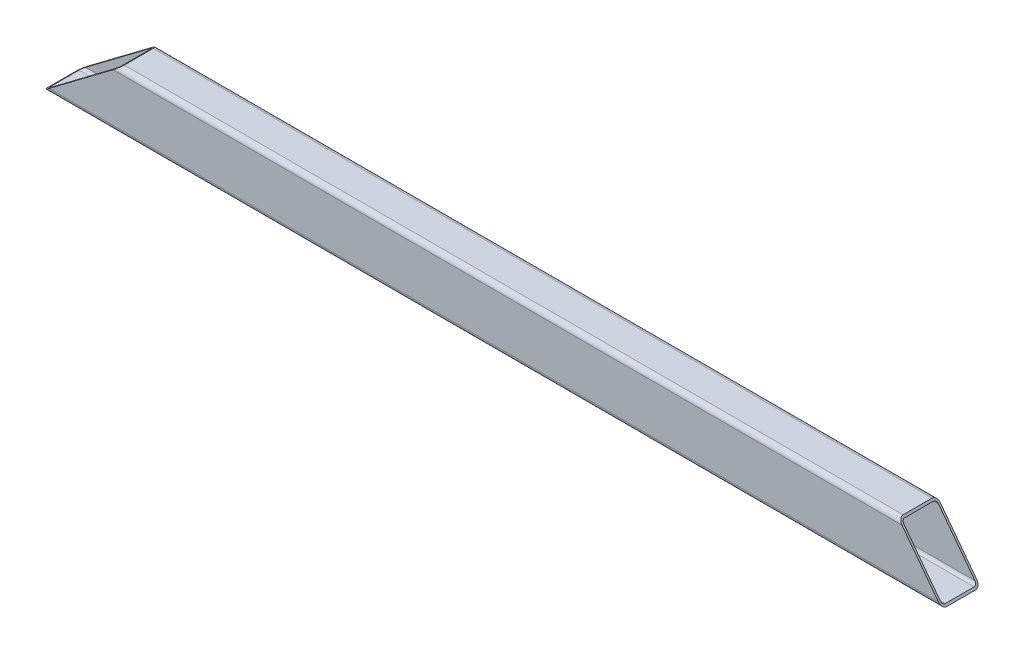
ISO-10303-21;
HEADER;
FILE_DESCRIPTION(('STEP AP214'),'2;1');
FILE_NAME('part.step','',(''),(''),'','','');
FILE_SCHEMA(('AUTOMOTIVE_DESIGN { 1 0 10303 214 1 1 1 1 }'));
ENDSEC;
DATA;
#1=APPLICATION_CONTEXT('core data for automotive mechanical design processes');
#2=APPLICATION_PROTOCOL_DEFINITION('international standard','automotive_design',2000,#1);
#3=PRODUCT_CONTEXT('',#1,'mechanical');
#4=PRODUCT('Part','Part','',(#3));
#5=PRODUCT_RELATED_PRODUCT_CATEGORY('part','',(#4));
#6=PRODUCT_DEFINITION_FORMATION('','',#4);
#7=PRODUCT_DEFINITION_CONTEXT('part definition',#1,'design');
#8=PRODUCT_DEFINITION('design','',#6,#7);
#9=PRODUCT_DEFINITION_SHAPE('','',#8);
#10=(LENGTH_UNIT() NAMED_UNIT(*) SI_UNIT(.MILLI.,.METRE.));
#11=(NAMED_UNIT(*) PLANE_ANGLE_UNIT() SI_UNIT($,.RADIAN.));
#12=(NAMED_UNIT(*) SI_UNIT($,.STERADIAN.) SOLID_ANGLE_UNIT());
#13=UNCERTAINTY_MEASURE_WITH_UNIT(LENGTH_MEASURE(1.E-05),#10,'distance_accuracy_value','');
#14=(GEOMETRIC_REPRESENTATION_CONTEXT(3) GLOBAL_UNCERTAINTY_ASSIGNED_CONTEXT((#13)) GLOBAL_UNIT_ASSIGNED_CONTEXT((#10,
#11,#12)) REPRESENTATION_CONTEXT('',''));
#15=CARTESIAN_POINT('',(0.,0.,0.));
#16=DIRECTION('',(0.,0.,1.));
#17=DIRECTION('',(1.,0.,0.));
#18=AXIS2_PLACEMENT_3D('',#15,#16,#17);
#19=CARTESIAN_POINT('',(941.8082,-49.9999999999998,30.));
#20=DIRECTION('',(-1.,0.,0.));
#21=DIRECTION('',(0.,-1.,0.));
#22=AXIS2_PLACEMENT_3D('',#19,#20,#21);
#23=CYLINDRICAL_SURFACE('',#22,6.);
#24=CARTESIAN_POINT('',(-911.921350372571,-50.,30.));
#25=DIRECTION('',(0.601815023152053,-0.79863551004729,0.));
#26=DIRECTION('',(-0.79863551004729,-0.601815023152053,0.));
#27=AXIS2_PLACEMENT_3D('',#24,#25,#26);
#28=ELLIPSE('',#27,9.96984084673483,6.);
#29=CARTESIAN_POINT('',(-911.921350372572,-50.0000000000001,36.));
#30=VERTEX_POINT('',#29);
#31=CARTESIAN_POINT('',(-919.883619302294,-56.,30.));
#32=VERTEX_POINT('',#31);
#33=EDGE_CURVE('E84',#30,#32,#28,.T.);
#34=ORIENTED_EDGE('',*,*,#33,.F.);
#35=DIRECTION('',(-1.,0.,0.));
#36=VECTOR('',#35,1.);
#37=CARTESIAN_POINT('',(941.8082,-49.9999999999998,36.));
#38=LINE('',#37,#36);
#39=CARTESIAN_POINT('',(934.272659498973,-50.,36.));
#40=VERTEX_POINT('',#39);
#41=EDGE_CURVE('E70',#40,#30,#38,.T.);
#42=ORIENTED_EDGE('',*,*,#41,.F.);
#43=CARTESIAN_POINT('',(934.272659498972,-49.9999999999997,30.));
#44=DIRECTION('',(-0.798635510047296,-0.601815023152044,0.));
#45=DIRECTION('',(-0.601815023152044,0.798635510047296,0.));
#46=AXIS2_PLACEMENT_3D('',#43,#44,#45);
#47=ELLIPSE('',#46,7.51281394893732,6.);
#48=CARTESIAN_POINT('',(938.793983799589,-55.9999999999996,30.));
#49=VERTEX_POINT('',#48);
#50=EDGE_CURVE('E254',#49,#40,#47,.T.);
#51=ORIENTED_EDGE('',*,*,#50,.F.);
#52=DIRECTION('',(-1.,0.,0.));
#53=VECTOR('',#52,1.);
#54=CARTESIAN_POINT('',(941.808200000001,-55.9999999999997,30.));
#55=LINE('',#54,#53);
#56=EDGE_CURVE('E215',#49,#32,#55,.T.);
#57=ORIENTED_EDGE('',*,*,#56,.T.);
#58=EDGE_LOOP('',(#34,#42,#51,#57));
#59=FACE_BOUND('',#58,.T.);
#60=ADVANCED_FACE('F62',(#59),#23,.F.);
#61=CARTESIAN_POINT('',(941.8082,-49.9999999999998,36.));
#62=DIRECTION('',(0.,0.,-1.));
#63=DIRECTION('',(-1.,0.,0.));
#64=AXIS2_PLACEMENT_3D('',#61,#62,#63);
#65=PLANE('',#64);
#66=DIRECTION('',(-0.79863551004729,-0.601815023152053,0.));
#67=VECTOR('',#66,1.);
#68=CARTESIAN_POINT('',(270.42198064597,840.959605701061,36.));
#69=LINE('',#68,#67);
#70=CARTESIAN_POINT('',(-779.216868210532,50.,36.));
#71=VERTEX_POINT('',#70);
#72=EDGE_CURVE('E252',#71,#30,#69,.T.);
#73=ORIENTED_EDGE('',*,*,#72,.F.);
#74=DIRECTION('',(-1.,0.,0.));
#75=VECTOR('',#74,1.);
#76=CARTESIAN_POINT('',(941.8082,50.0000000000003,36.));
#77=LINE('',#76,#75);
#78=CARTESIAN_POINT('',(858.917254488694,50.0000000000003,36.));
#79=VERTEX_POINT('',#78);
#80=EDGE_CURVE('E243',#79,#71,#77,.T.);
#81=ORIENTED_EDGE('',*,*,#80,.F.);
#82=DIRECTION('',(-0.601815023152044,0.798635510047296,0.));
#83=VECTOR('',#82,1.);
#84=CARTESIAN_POINT('',(937.001891520308,-53.6218132209147,36.));
#85=LINE('',#84,#83);
#86=EDGE_CURVE('E253',#40,#79,#85,.T.);
#87=ORIENTED_EDGE('',*,*,#86,.F.);
#88=ORIENTED_EDGE('',*,*,#41,.T.);
#89=EDGE_LOOP('',(#73,#81,#87,#88));
#90=FACE_BOUND('',#89,.T.);
#91=ADVANCED_FACE('F250',(#90),#65,.T.);
#92=CARTESIAN_POINT('',(941.808200000001,50.0000000000001,30.));
#93=DIRECTION('',(-1.,0.,0.));
#94=DIRECTION('',(0.,-1.,0.));
#95=AXIS2_PLACEMENT_3D('',#92,#93,#94);
#96=CYLINDRICAL_SURFACE('',#95,6.);
#97=CARTESIAN_POINT('',(-779.216868210532,50.,30.));
#98=DIRECTION('',(0.601815023152053,-0.79863551004729,0.));
#99=DIRECTION('',(-0.79863551004729,-0.601815023152053,0.));
#100=AXIS2_PLACEMENT_3D('',#97,#98,#99);
#101=ELLIPSE('',#100,9.96984084673483,6.);
#102=CARTESIAN_POINT('',(-771.25459928081,56.,30.));
#103=VERTEX_POINT('',#102);
#104=EDGE_CURVE('E256',#103,#71,#101,.T.);
#105=ORIENTED_EDGE('',*,*,#104,.F.);
#106=DIRECTION('',(-1.,0.,0.));
#107=VECTOR('',#106,1.);
#108=CARTESIAN_POINT('',(941.8082,56.0000000000001,30.));
#109=LINE('',#108,#107);
#110=CARTESIAN_POINT('',(854.395930188077,56.0000000000001,30.));
#111=VERTEX_POINT('',#110);
#112=EDGE_CURVE('E240',#111,#103,#109,.T.);
#113=ORIENTED_EDGE('',*,*,#112,.F.);
#114=CARTESIAN_POINT('',(858.917254488694,50.0000000000003,30.));
#115=DIRECTION('',(-0.798635510047296,-0.601815023152044,0.));
#116=DIRECTION('',(-0.601815023152044,0.798635510047296,0.));
#117=AXIS2_PLACEMENT_3D('',#114,#115,#116);
#118=ELLIPSE('',#117,7.51281394893732,6.);
#119=EDGE_CURVE('E282',#79,#111,#118,.T.);
#120=ORIENTED_EDGE('',*,*,#119,.F.);
#121=ORIENTED_EDGE('',*,*,#80,.T.);
#122=EDGE_LOOP('',(#105,#113,#120,#121));
#123=FACE_BOUND('',#122,.T.);
#124=ADVANCED_FACE('F321',(#123),#96,.F.);
#125=CARTESIAN_POINT('',(941.8082,56.0000000000001,30.));
#126=DIRECTION('',(0.,-1.,0.));
#127=DIRECTION('',(1.,0.,0.));
#128=AXIS2_PLACEMENT_3D('',#125,#126,#127);
#129=PLANE('',#128);
#130=DIRECTION('',(0.,0.,1.));
#131=VECTOR('',#130,1.);
#132=CARTESIAN_POINT('',(-771.25459928081,56.,29.9999999999997));
#133=LINE('',#132,#131);
#134=CARTESIAN_POINT('',(-771.25459928081,56.,-30.));
#135=VERTEX_POINT('',#134);
#136=EDGE_CURVE('E316',#135,#103,#133,.T.);
#137=ORIENTED_EDGE('',*,*,#136,.F.);
#138=DIRECTION('',(-1.,0.,0.));
#139=VECTOR('',#138,1.);
#140=CARTESIAN_POINT('',(941.8082,56.0000000000001,-30.));
#141=LINE('',#140,#139);
#142=CARTESIAN_POINT('',(854.395930188077,56.0000000000001,-30.));
#143=VERTEX_POINT('',#142);
#144=EDGE_CURVE('E237',#143,#135,#141,.T.);
#145=ORIENTED_EDGE('',*,*,#144,.F.);
#146=DIRECTION('',(0.,0.,-1.));
#147=VECTOR('',#146,1.);
#148=CARTESIAN_POINT('',(854.395930188077,56.0000000000001,30.));
#149=LINE('',#148,#147);
#150=EDGE_CURVE('E280',#111,#143,#149,.T.);
#151=ORIENTED_EDGE('',*,*,#150,.F.);
#152=ORIENTED_EDGE('',*,*,#112,.T.);
#153=EDGE_LOOP('',(#137,#145,#151,#152));
#154=FACE_BOUND('',#153,.T.);
#155=ADVANCED_FACE('F325',(#154),#129,.T.);
#156=CARTESIAN_POINT('',(941.808200000001,50.0000000000001,-30.));
#157=DIRECTION('',(-1.,0.,0.));
#158=DIRECTION('',(0.,-1.,0.));
#159=AXIS2_PLACEMENT_3D('',#156,#157,#158);
#160=CYLINDRICAL_SURFACE('',#159,6.);
#161=CARTESIAN_POINT('',(-779.216868210532,50.,-30.));
#162=DIRECTION('',(0.601815023152053,-0.79863551004729,0.));
#163=DIRECTION('',(-0.79863551004729,-0.601815023152053,0.));
#164=AXIS2_PLACEMENT_3D('',#161,#162,#163);
#165=ELLIPSE('',#164,9.96984084673483,6.);
#166=CARTESIAN_POINT('',(-779.216868210532,50.,-36.));
#167=VERTEX_POINT('',#166);
#168=EDGE_CURVE('E314',#167,#135,#165,.T.);
#169=ORIENTED_EDGE('',*,*,#168,.F.);
#170=DIRECTION('',(-1.,0.,0.));
#171=VECTOR('',#170,1.);
#172=CARTESIAN_POINT('',(941.8082,50.0000000000003,-36.));
#173=LINE('',#172,#171);
#174=CARTESIAN_POINT('',(858.917254488694,50.0000000000003,-36.));
#175=VERTEX_POINT('',#174);
#176=EDGE_CURVE('E234',#175,#167,#173,.T.);
#177=ORIENTED_EDGE('',*,*,#176,.F.);
#178=CARTESIAN_POINT('',(858.917254488694,50.0000000000003,-30.));
#179=DIRECTION('',(-0.798635510047296,-0.601815023152044,0.));
#180=DIRECTION('',(-0.601815023152044,0.798635510047296,0.));
#181=AXIS2_PLACEMENT_3D('',#178,#179,#180);
#182=ELLIPSE('',#181,7.51281394893732,6.);
#183=EDGE_CURVE('E278',#143,#175,#182,.T.);
#184=ORIENTED_EDGE('',*,*,#183,.F.);
#185=ORIENTED_EDGE('',*,*,#144,.T.);
#186=EDGE_LOOP('',(#169,#177,#184,#185));
#187=FACE_BOUND('',#186,.T.);
#188=ADVANCED_FACE('F333',(#187),#160,.F.);
#189=CARTESIAN_POINT('',(941.8082,50.0000000000003,-36.));
#190=DIRECTION('',(0.,0.,1.));
#191=DIRECTION('',(0.,-1.,0.));
#192=AXIS2_PLACEMENT_3D('',#189,#190,#191);
#193=PLANE('',#192);
#194=DIRECTION('',(0.79863551004729,0.601815023152053,0.));
#195=VECTOR('',#194,1.);
#196=CARTESIAN_POINT('',(318.485065442886,877.177737910211,-35.9999999999998));
#197=LINE('',#196,#195);
#198=CARTESIAN_POINT('',(-911.921350372571,-49.9999999999999,-36.));
#199=VERTEX_POINT('',#198);
#200=EDGE_CURVE('E312',#199,#167,#197,.T.);
#201=ORIENTED_EDGE('',*,*,#200,.F.);
#202=DIRECTION('',(-1.,0.,0.));
#203=VECTOR('',#202,1.);
#204=CARTESIAN_POINT('',(941.8082,-49.9999999999998,-36.));
#205=LINE('',#204,#203);
#206=CARTESIAN_POINT('',(934.272659498972,-49.9999999999997,-36.));
#207=VERTEX_POINT('',#206);
#208=EDGE_CURVE('E227',#207,#199,#205,.T.);
#209=ORIENTED_EDGE('',*,*,#208,.F.);
#210=DIRECTION('',(0.601815023152044,-0.798635510047296,0.));
#211=VECTOR('',#210,1.);
#212=CARTESIAN_POINT('',(888.938806723393,10.1600545699359,-36.));
#213=LINE('',#212,#211);
#214=EDGE_CURVE('E276',#175,#207,#213,.T.);
#215=ORIENTED_EDGE('',*,*,#214,.F.);
#216=ORIENTED_EDGE('',*,*,#176,.T.);
#217=EDGE_LOOP('',(#201,#209,#215,#216));
#218=FACE_BOUND('',#217,.T.);
#219=ADVANCED_FACE('F336',(#218),#193,.T.);
#220=CARTESIAN_POINT('',(941.8082,-49.9999999999998,-30.));
#221=DIRECTION('',(-1.,0.,0.));
#222=DIRECTION('',(0.,-1.,0.));
#223=AXIS2_PLACEMENT_3D('',#220,#221,#222);
#224=CYLINDRICAL_SURFACE('',#223,6.);
#225=CARTESIAN_POINT('',(-911.921350372571,-50.,-30.));
#226=DIRECTION('',(0.601815023152053,-0.79863551004729,0.));
#227=DIRECTION('',(-0.79863551004729,-0.601815023152053,0.));
#228=AXIS2_PLACEMENT_3D('',#225,#226,#227);
#229=ELLIPSE('',#228,9.96984084673483,6.);
#230=CARTESIAN_POINT('',(-919.883619302294,-56.,-30.));
#231=VERTEX_POINT('',#230);
#232=EDGE_CURVE('E306',#231,#199,#229,.T.);
#233=ORIENTED_EDGE('',*,*,#232,.F.);
#234=DIRECTION('',(-1.,0.,0.));
#235=VECTOR('',#234,1.);
#236=CARTESIAN_POINT('',(941.808200000001,-55.9999999999997,-30.));
#237=LINE('',#236,#235);
#238=CARTESIAN_POINT('',(938.793983799589,-55.9999999999996,-30.));
#239=VERTEX_POINT('',#238);
#240=EDGE_CURVE('E221',#239,#231,#237,.T.);
#241=ORIENTED_EDGE('',*,*,#240,.F.);
#242=CARTESIAN_POINT('',(934.272659498972,-49.9999999999997,-30.));
#243=DIRECTION('',(-0.798635510047296,-0.601815023152044,0.));
#244=DIRECTION('',(-0.601815023152044,0.798635510047296,0.));
#245=AXIS2_PLACEMENT_3D('',#242,#243,#244);
#246=ELLIPSE('',#245,7.51281394893732,6.);
#247=EDGE_CURVE('E274',#207,#239,#246,.T.);
#248=ORIENTED_EDGE('',*,*,#247,.F.);
#249=ORIENTED_EDGE('',*,*,#208,.T.);
#250=EDGE_LOOP('',(#233,#241,#248,#249));
#251=FACE_BOUND('',#250,.T.);
#252=ADVANCED_FACE('F343',(#251),#224,.F.);
#253=CARTESIAN_POINT('',(941.8082,-49.9999999999998,30.));
#254=DIRECTION('',(-1.,0.,0.));
#255=DIRECTION('',(0.,-1.,0.));
#256=AXIS2_PLACEMENT_3D('',#253,#254,#255);
#257=CYLINDRICAL_SURFACE('',#256,10.);
#258=DIRECTION('',(-1.,0.,0.));
#259=VECTOR('',#258,1.);
#260=CARTESIAN_POINT('',(941.8082,-49.9999999999998,40.));
#261=LINE('',#260,#259);
#262=CARTESIAN_POINT('',(934.272659498973,-50.,40.));
#263=VERTEX_POINT('',#262);
#264=CARTESIAN_POINT('',(-911.921350372572,-50.,40.));
#265=VERTEX_POINT('',#264);
#266=EDGE_CURVE('E195',#263,#265,#261,.T.);
#267=ORIENTED_EDGE('',*,*,#266,.T.);
#268=CARTESIAN_POINT('',(-911.921350372571,-50.,30.));
#269=DIRECTION('',(0.601815023152053,-0.79863551004729,0.));
#270=DIRECTION('',(-0.79863551004729,-0.601815023152053,0.));
#271=AXIS2_PLACEMENT_3D('',#268,#269,#270);
#272=ELLIPSE('',#271,16.6164014112247,10.);
#273=CARTESIAN_POINT('',(-925.191798588775,-59.9999999999999,29.9999999999999));
#274=VERTEX_POINT('',#273);
#275=EDGE_CURVE('E77',#265,#274,#272,.T.);
#276=ORIENTED_EDGE('',*,*,#275,.T.);
#277=DIRECTION('',(-1.,0.,0.));
#278=VECTOR('',#277,1.);
#279=CARTESIAN_POINT('',(941.8082,-59.9999999999996,29.9999999999999));
#280=LINE('',#279,#278);
#281=CARTESIAN_POINT('',(941.8082,-59.9999999999996,29.9999999999999));
#282=VERTEX_POINT('',#281);
#283=EDGE_CURVE('E213',#282,#274,#280,.T.);
#284=ORIENTED_EDGE('',*,*,#283,.F.);
#285=CARTESIAN_POINT('',(934.272659498972,-49.9999999999997,30.));
#286=DIRECTION('',(-0.798635510047296,-0.601815023152044,0.));
#287=DIRECTION('',(-0.601815023152044,0.798635510047296,0.));
#288=AXIS2_PLACEMENT_3D('',#285,#286,#287);
#289=ELLIPSE('',#288,12.5213565815622,10.);
#290=EDGE_CURVE('E293',#282,#263,#289,.T.);
#291=ORIENTED_EDGE('',*,*,#290,.T.);
#292=EDGE_LOOP('',(#267,#276,#284,#291));
#293=FACE_BOUND('',#292,.T.);
#294=ADVANCED_FACE('F64',(#293),#257,.T.);
#295=CARTESIAN_POINT('',(941.8082,-59.9999999999996,29.9999999999999));
#296=DIRECTION('',(0.,1.,0.));
#297=DIRECTION('',(-1.,0.,0.));
#298=AXIS2_PLACEMENT_3D('',#295,#296,#297);
#299=PLANE('',#298);
#300=ORIENTED_EDGE('',*,*,#283,.T.);
#301=DIRECTION('',(0.,0.,1.));
#302=VECTOR('',#301,1.);
#303=CARTESIAN_POINT('',(-925.191798588775,-59.9999999999997,-40.));
#304=LINE('',#303,#302);
#305=CARTESIAN_POINT('',(-925.191798588775,-59.9999999999997,-30.));
#306=VERTEX_POINT('',#305);
#307=EDGE_CURVE('E303',#306,#274,#304,.T.);
#308=ORIENTED_EDGE('',*,*,#307,.F.);
#309=DIRECTION('',(-1.,0.,0.));
#310=VECTOR('',#309,1.);
#311=CARTESIAN_POINT('',(941.8082,-59.9999999999996,-29.9999999999999));
#312=LINE('',#311,#310);
#313=CARTESIAN_POINT('',(941.8082,-59.9999999999996,-29.9999999999999));
#314=VERTEX_POINT('',#313);
#315=EDGE_CURVE('E211',#314,#306,#312,.T.);
#316=ORIENTED_EDGE('',*,*,#315,.F.);
#317=DIRECTION('',(0.,0.,-1.));
#318=VECTOR('',#317,1.);
#319=CARTESIAN_POINT('',(941.8082,-59.9999999999996,29.9999999999999));
#320=LINE('',#319,#318);
#321=EDGE_CURVE('E199',#282,#314,#320,.T.);
#322=ORIENTED_EDGE('',*,*,#321,.F.);
#323=EDGE_LOOP('',(#300,#308,#316,#322));
#324=FACE_BOUND('',#323,.T.);
#325=ADVANCED_FACE('F302',(#324),#299,.F.);
#326=CARTESIAN_POINT('',(941.8082,-49.9999999999998,-30.));
#327=DIRECTION('',(-1.,0.,0.));
#328=DIRECTION('',(0.,-1.,0.));
#329=AXIS2_PLACEMENT_3D('',#326,#327,#328);
#330=CYLINDRICAL_SURFACE('',#329,10.);
#331=ORIENTED_EDGE('',*,*,#315,.T.);
#332=CARTESIAN_POINT('',(-911.921350372571,-50.,-30.));
#333=DIRECTION('',(0.601815023152053,-0.79863551004729,0.));
#334=DIRECTION('',(-0.79863551004729,-0.601815023152053,0.));
#335=AXIS2_PLACEMENT_3D('',#332,#333,#334);
#336=ELLIPSE('',#335,16.6164014112247,10.);
#337=CARTESIAN_POINT('',(-911.921350372571,-49.9999999999999,-40.));
#338=VERTEX_POINT('',#337);
#339=EDGE_CURVE('E262',#306,#338,#336,.T.);
#340=ORIENTED_EDGE('',*,*,#339,.T.);
#341=DIRECTION('',(-1.,0.,0.));
#342=VECTOR('',#341,1.);
#343=CARTESIAN_POINT('',(941.8082,-49.9999999999998,-40.));
#344=LINE('',#343,#342);
#345=CARTESIAN_POINT('',(934.272659498973,-50.,-40.));
#346=VERTEX_POINT('',#345);
#347=EDGE_CURVE('E208',#346,#338,#344,.T.);
#348=ORIENTED_EDGE('',*,*,#347,.F.);
#349=CARTESIAN_POINT('',(934.272659498972,-49.9999999999997,-30.));
#350=DIRECTION('',(-0.798635510047296,-0.601815023152044,0.));
#351=DIRECTION('',(-0.601815023152044,0.798635510047296,0.));
#352=AXIS2_PLACEMENT_3D('',#349,#350,#351);
#353=ELLIPSE('',#352,12.5213565815622,10.);
#354=EDGE_CURVE('E291',#346,#314,#353,.T.);
#355=ORIENTED_EDGE('',*,*,#354,.T.);
#356=EDGE_LOOP('',(#331,#340,#348,#355));
#357=FACE_BOUND('',#356,.T.);
#358=ADVANCED_FACE('F301',(#357),#330,.T.);
#359=CARTESIAN_POINT('',(941.8082,50.0000000000003,-40.));
#360=DIRECTION('',(0.,0.,1.));
#361=DIRECTION('',(1.,0.,0.));
#362=AXIS2_PLACEMENT_3D('',#359,#360,#361);
#363=PLANE('',#362);
#364=ORIENTED_EDGE('',*,*,#347,.T.);
#365=DIRECTION('',(0.79863551004729,0.601815023152053,0.));
#366=VECTOR('',#365,1.);
#367=CARTESIAN_POINT('',(-925.191798588775,-59.9999999999997,-40.));
#368=LINE('',#367,#366);
#369=CARTESIAN_POINT('',(-779.216868210531,50.0000000000002,-40.));
#370=VERTEX_POINT('',#369);
#371=EDGE_CURVE('E180',#338,#370,#368,.T.);
#372=ORIENTED_EDGE('',*,*,#371,.T.);
#373=DIRECTION('',(-1.,0.,0.));
#374=VECTOR('',#373,1.);
#375=CARTESIAN_POINT('',(941.8082,50.0000000000003,-40.));
#376=LINE('',#375,#374);
#377=CARTESIAN_POINT('',(858.917254488694,50.0000000000003,-40.));
#378=VERTEX_POINT('',#377);
#379=EDGE_CURVE('E205',#378,#370,#376,.T.);
#380=ORIENTED_EDGE('',*,*,#379,.F.);
#381=DIRECTION('',(0.601815023152044,-0.798635510047296,0.));
#382=VECTOR('',#381,1.);
#383=CARTESIAN_POINT('',(941.8082,-59.9999999999996,-40.));
#384=LINE('',#383,#382);
#385=EDGE_CURVE('E266',#378,#346,#384,.T.);
#386=ORIENTED_EDGE('',*,*,#385,.T.);
#387=EDGE_LOOP('',(#364,#372,#380,#386));
#388=FACE_BOUND('',#387,.T.);
#389=ADVANCED_FACE('F372',(#388),#363,.F.);
#390=CARTESIAN_POINT('',(941.808200000001,50.0000000000001,-30.));
#391=DIRECTION('',(-1.,0.,0.));
#392=DIRECTION('',(0.,-1.,0.));
#393=AXIS2_PLACEMENT_3D('',#390,#391,#392);
#394=CYLINDRICAL_SURFACE('',#393,10.);
#395=ORIENTED_EDGE('',*,*,#379,.T.);
#396=CARTESIAN_POINT('',(-779.216868210532,50.,-30.));
#397=DIRECTION('',(0.601815023152053,-0.79863551004729,0.));
#398=DIRECTION('',(-0.79863551004729,-0.601815023152053,0.));
#399=AXIS2_PLACEMENT_3D('',#396,#397,#398);
#400=ELLIPSE('',#399,16.6164014112247,10.);
#401=CARTESIAN_POINT('',(-765.946419994328,60.0000000000002,-29.9999999999999));
#402=VERTEX_POINT('',#401);
#403=EDGE_CURVE('E190',#370,#402,#400,.T.);
#404=ORIENTED_EDGE('',*,*,#403,.T.);
#405=DIRECTION('',(-1.,0.,0.));
#406=VECTOR('',#405,1.);
#407=CARTESIAN_POINT('',(941.808200000001,60.0000000000003,-29.9999999999999));
#408=LINE('',#407,#406);
#409=CARTESIAN_POINT('',(851.381713987666,60.0000000000001,-29.9999999999999));
#410=VERTEX_POINT('',#409);
#411=EDGE_CURVE('E197',#410,#402,#408,.T.);
#412=ORIENTED_EDGE('',*,*,#411,.F.);
#413=CARTESIAN_POINT('',(858.917254488694,50.0000000000003,-30.));
#414=DIRECTION('',(-0.798635510047296,-0.601815023152044,0.));
#415=DIRECTION('',(-0.601815023152044,0.798635510047296,0.));
#416=AXIS2_PLACEMENT_3D('',#413,#414,#415);
#417=ELLIPSE('',#416,12.5213565815622,10.);
#418=EDGE_CURVE('E288',#410,#378,#417,.T.);
#419=ORIENTED_EDGE('',*,*,#418,.T.);
#420=EDGE_LOOP('',(#395,#404,#412,#419));
#421=FACE_BOUND('',#420,.T.);
#422=ADVANCED_FACE('F368',(#421),#394,.T.);
#423=CARTESIAN_POINT('',(941.808200000001,60.0000000000003,29.9999999999999));
#424=DIRECTION('',(0.,-1.,0.));
#425=DIRECTION('',(1.,0.,0.));
#426=AXIS2_PLACEMENT_3D('',#423,#424,#425);
#427=PLANE('',#426);
#428=ORIENTED_EDGE('',*,*,#411,.T.);
#429=DIRECTION('',(0.,0.,1.));
#430=VECTOR('',#429,1.);
#431=CARTESIAN_POINT('',(-765.946419994328,60.0000000000002,-40.));
#432=LINE('',#431,#430);
#433=CARTESIAN_POINT('',(-765.946419994328,60.,30.));
#434=VERTEX_POINT('',#433);
#435=EDGE_CURVE('E304',#402,#434,#432,.T.);
#436=ORIENTED_EDGE('',*,*,#435,.T.);
#437=DIRECTION('',(-1.,0.,0.));
#438=VECTOR('',#437,1.);
#439=CARTESIAN_POINT('',(941.808200000001,60.0000000000003,29.9999999999999));
#440=LINE('',#439,#438);
#441=CARTESIAN_POINT('',(851.381713987666,60.0000000000001,30.));
#442=VERTEX_POINT('',#441);
#443=EDGE_CURVE('E189',#442,#434,#440,.T.);
#444=ORIENTED_EDGE('',*,*,#443,.F.);
#445=DIRECTION('',(0.,0.,1.));
#446=VECTOR('',#445,1.);
#447=CARTESIAN_POINT('',(851.381713987666,60.0000000000001,-40.));
#448=LINE('',#447,#446);
#449=EDGE_CURVE('E269',#410,#442,#448,.T.);
#450=ORIENTED_EDGE('',*,*,#449,.F.);
#451=EDGE_LOOP('',(#428,#436,#444,#450));
#452=FACE_BOUND('',#451,.T.);
#453=ADVANCED_FACE('F365',(#452),#427,.F.);
#454=CARTESIAN_POINT('',(941.808200000001,50.0000000000001,30.));
#455=DIRECTION('',(-1.,0.,0.));
#456=DIRECTION('',(0.,-1.,0.));
#457=AXIS2_PLACEMENT_3D('',#454,#455,#456);
#458=CYLINDRICAL_SURFACE('',#457,10.);
#459=ORIENTED_EDGE('',*,*,#443,.T.);
#460=CARTESIAN_POINT('',(-779.216868210532,50.,30.));
#461=DIRECTION('',(0.601815023152053,-0.79863551004729,0.));
#462=DIRECTION('',(-0.79863551004729,-0.601815023152053,0.));
#463=AXIS2_PLACEMENT_3D('',#460,#461,#462);
#464=ELLIPSE('',#463,16.6164014112247,10.);
#465=CARTESIAN_POINT('',(-779.216868210532,50.0000000000002,40.));
#466=VERTEX_POINT('',#465);
#467=EDGE_CURVE('E174',#434,#466,#464,.T.);
#468=ORIENTED_EDGE('',*,*,#467,.T.);
#469=DIRECTION('',(-1.,0.,0.));
#470=VECTOR('',#469,1.);
#471=CARTESIAN_POINT('',(941.8082,50.0000000000003,40.));
#472=LINE('',#471,#470);
#473=CARTESIAN_POINT('',(858.917254488694,50.0000000000003,40.));
#474=VERTEX_POINT('',#473);
#475=EDGE_CURVE('E187',#474,#466,#472,.T.);
#476=ORIENTED_EDGE('',*,*,#475,.F.);
#477=CARTESIAN_POINT('',(858.917254488694,50.0000000000003,30.));
#478=DIRECTION('',(-0.798635510047296,-0.601815023152044,0.));
#479=DIRECTION('',(-0.601815023152044,0.798635510047296,0.));
#480=AXIS2_PLACEMENT_3D('',#477,#478,#479);
#481=ELLIPSE('',#480,12.5213565815622,10.);
#482=EDGE_CURVE('E286',#474,#442,#481,.T.);
#483=ORIENTED_EDGE('',*,*,#482,.T.);
#484=EDGE_LOOP('',(#459,#468,#476,#483));
#485=FACE_BOUND('',#484,.T.);
#486=ADVANCED_FACE('F185',(#485),#458,.T.);
#487=CARTESIAN_POINT('',(941.8082,-49.9999999999998,40.));
#488=DIRECTION('',(0.,0.,-1.));
#489=DIRECTION('',(-1.,0.,0.));
#490=AXIS2_PLACEMENT_3D('',#487,#488,#489);
#491=PLANE('',#490);
#492=ORIENTED_EDGE('',*,*,#475,.T.);
#493=DIRECTION('',(0.79863551004729,0.601815023152053,0.));
#494=VECTOR('',#493,1.);
#495=CARTESIAN_POINT('',(-925.191798588775,-59.9999999999999,40.));
#496=LINE('',#495,#494);
#497=EDGE_CURVE('E171',#265,#466,#496,.T.);
#498=ORIENTED_EDGE('',*,*,#497,.F.);
#499=ORIENTED_EDGE('',*,*,#266,.F.);
#500=DIRECTION('',(0.601815023152044,-0.798635510047296,0.));
#501=VECTOR('',#500,1.);
#502=CARTESIAN_POINT('',(941.8082,-59.9999999999996,40.));
#503=LINE('',#502,#501);
#504=EDGE_CURVE('E194',#474,#263,#503,.T.);
#505=ORIENTED_EDGE('',*,*,#504,.F.);
#506=EDGE_LOOP('',(#492,#498,#499,#505));
#507=FACE_BOUND('',#506,.T.);
#508=ADVANCED_FACE('F193',(#507),#491,.F.);
#509=CARTESIAN_POINT('',(941.808200000001,-55.9999999999997,30.));
#510=DIRECTION('',(0.,1.,0.));
#511=DIRECTION('',(-1.,0.,0.));
#512=AXIS2_PLACEMENT_3D('',#509,#510,#511);
#513=PLANE('',#512);
#514=DIRECTION('',(0.,0.,-1.));
#515=VECTOR('',#514,1.);
#516=CARTESIAN_POINT('',(-919.883619302294,-56.,29.9999999999997));
#517=LINE('',#516,#515);
#518=EDGE_CURVE('E12',#32,#231,#517,.T.);
#519=ORIENTED_EDGE('',*,*,#518,.F.);
#520=ORIENTED_EDGE('',*,*,#56,.F.);
#521=DIRECTION('',(0.,0.,1.));
#522=VECTOR('',#521,1.);
#523=CARTESIAN_POINT('',(938.793983799589,-55.9999999999996,30.));
#524=LINE('',#523,#522);
#525=EDGE_CURVE('E272',#239,#49,#524,.T.);
#526=ORIENTED_EDGE('',*,*,#525,.F.);
#527=ORIENTED_EDGE('',*,*,#240,.T.);
#528=EDGE_LOOP('',(#519,#520,#526,#527));
#529=FACE_BOUND('',#528,.T.);
#530=ADVANCED_FACE('F345',(#529),#513,.T.);
#531=CARTESIAN_POINT('',(941.8082,-59.9999999999996,-40.));
#532=DIRECTION('',(-0.798635510047296,-0.601815023152044,0.));
#533=DIRECTION('',(0.601815023152044,-0.798635510047296,0.));
#534=AXIS2_PLACEMENT_3D('',#531,#532,#533);
#535=PLANE('',#534);
#536=ORIENTED_EDGE('',*,*,#50,.T.);
#537=ORIENTED_EDGE('',*,*,#86,.T.);
#538=ORIENTED_EDGE('',*,*,#119,.T.);
#539=ORIENTED_EDGE('',*,*,#150,.T.);
#540=ORIENTED_EDGE('',*,*,#183,.T.);
#541=ORIENTED_EDGE('',*,*,#214,.T.);
#542=ORIENTED_EDGE('',*,*,#247,.T.);
#543=ORIENTED_EDGE('',*,*,#525,.T.);
#544=EDGE_LOOP('',(#536,#537,#538,#539,#540,#541,#542,#543));
#545=FACE_BOUND('',#544,.T.);
#546=ORIENTED_EDGE('',*,*,#321,.T.);
#547=ORIENTED_EDGE('',*,*,#354,.F.);
#548=ORIENTED_EDGE('',*,*,#385,.F.);
#549=ORIENTED_EDGE('',*,*,#418,.F.);
#550=ORIENTED_EDGE('',*,*,#449,.T.);
#551=ORIENTED_EDGE('',*,*,#482,.F.);
#552=ORIENTED_EDGE('',*,*,#504,.T.);
#553=ORIENTED_EDGE('',*,*,#290,.F.);
#554=EDGE_LOOP('',(#546,#547,#548,#549,#550,#551,#552,#553));
#555=FACE_BOUND('',#554,.T.);
#556=ADVANCED_FACE('F297',(#545,#555),#535,.F.);
#557=CARTESIAN_POINT('',(-925.191798588775,-59.9999999999997,-40.));
#558=DIRECTION('',(0.601815023152053,-0.79863551004729,0.));
#559=DIRECTION('',(0.79863551004729,0.601815023152053,0.));
#560=AXIS2_PLACEMENT_3D('',#557,#558,#559);
#561=PLANE('',#560);
#562=ORIENTED_EDGE('',*,*,#33,.T.);
#563=ORIENTED_EDGE('',*,*,#518,.T.);
#564=ORIENTED_EDGE('',*,*,#232,.T.);
#565=ORIENTED_EDGE('',*,*,#200,.T.);
#566=ORIENTED_EDGE('',*,*,#168,.T.);
#567=ORIENTED_EDGE('',*,*,#136,.T.);
#568=ORIENTED_EDGE('',*,*,#104,.T.);
#569=ORIENTED_EDGE('',*,*,#72,.T.);
#570=EDGE_LOOP('',(#562,#563,#564,#565,#566,#567,#568,#569));
#571=FACE_BOUND('',#570,.T.);
#572=ORIENTED_EDGE('',*,*,#497,.T.);
#573=ORIENTED_EDGE('',*,*,#467,.F.);
#574=ORIENTED_EDGE('',*,*,#435,.F.);
#575=ORIENTED_EDGE('',*,*,#403,.F.);
#576=ORIENTED_EDGE('',*,*,#371,.F.);
#577=ORIENTED_EDGE('',*,*,#339,.F.);
#578=ORIENTED_EDGE('',*,*,#307,.T.);
#579=ORIENTED_EDGE('',*,*,#275,.F.);
#580=EDGE_LOOP('',(#572,#573,#574,#575,#576,#577,#578,#579));
#581=FACE_BOUND('',#580,.T.);
#582=ADVANCED_FACE('F173',(#571,#581),#561,.F.);
#583=CLOSED_SHELL('',(#60,#91,#124,#155,#188,#219,#252,#294,#325,#358,#389,#422,#453,#486,#508,
#530,#556,#582));
#584=MANIFOLD_SOLID_BREP('B2',#583);
#585=ADVANCED_BREP_SHAPE_REPRESENTATION('',(#18,#584),#14);
#586=SHAPE_DEFINITION_REPRESENTATION(#9,#585);
ENDSEC;
END-ISO-10303-21;
